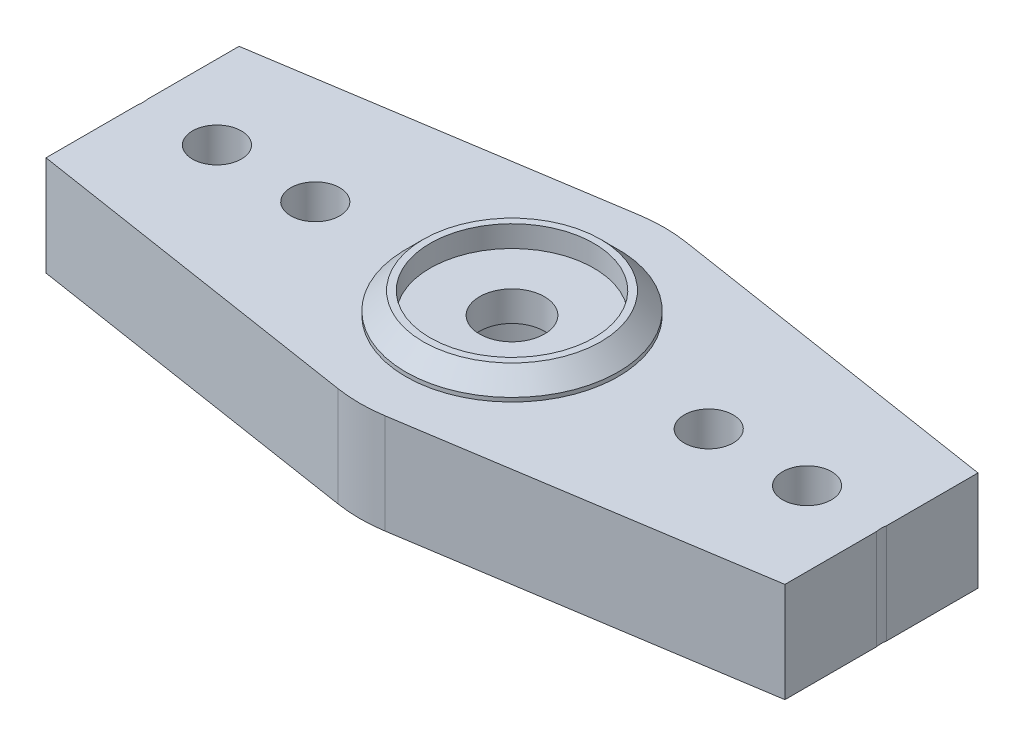
ISO-10303-21;
HEADER;
FILE_DESCRIPTION(('STEP AP214'),'2;1');
FILE_NAME('part.step','',(''),(''),'','','');
FILE_SCHEMA(('AUTOMOTIVE_DESIGN { 1 0 10303 214 1 1 1 1 }'));
ENDSEC;
DATA;
#1=APPLICATION_CONTEXT('core data for automotive mechanical design processes');
#2=APPLICATION_PROTOCOL_DEFINITION('international standard','automotive_design',2000,#1);
#3=PRODUCT_CONTEXT('',#1,'mechanical');
#4=PRODUCT('Part','Part','',(#3));
#5=PRODUCT_RELATED_PRODUCT_CATEGORY('part','',(#4));
#6=PRODUCT_DEFINITION_FORMATION('','',#4);
#7=PRODUCT_DEFINITION_CONTEXT('part definition',#1,'design');
#8=PRODUCT_DEFINITION('design','',#6,#7);
#9=PRODUCT_DEFINITION_SHAPE('','',#8);
#10=(LENGTH_UNIT() NAMED_UNIT(*) SI_UNIT(.MILLI.,.METRE.));
#11=(NAMED_UNIT(*) PLANE_ANGLE_UNIT() SI_UNIT($,.RADIAN.));
#12=(NAMED_UNIT(*) SI_UNIT($,.STERADIAN.) SOLID_ANGLE_UNIT());
#13=UNCERTAINTY_MEASURE_WITH_UNIT(LENGTH_MEASURE(1.E-05),#10,'distance_accuracy_value','');
#14=(GEOMETRIC_REPRESENTATION_CONTEXT(3) GLOBAL_UNCERTAINTY_ASSIGNED_CONTEXT((#13)) GLOBAL_UNIT_ASSIGNED_CONTEXT((#10,
#11,#12)) REPRESENTATION_CONTEXT('',''));
#15=CARTESIAN_POINT('',(0.,0.,0.));
#16=DIRECTION('',(0.,0.,1.));
#17=DIRECTION('',(1.,0.,0.));
#18=AXIS2_PLACEMENT_3D('',#15,#16,#17);
#19=CARTESIAN_POINT('',(0.,5.08,0.));
#20=DIRECTION('',(0.,-1.,0.));
#21=DIRECTION('',(0.,0.,-1.));
#22=AXIS2_PLACEMENT_3D('',#19,#20,#21);
#23=CYLINDRICAL_SURFACE('',#22,1.651);
#24=CARTESIAN_POINT('',(0.,5.08,0.));
#25=DIRECTION('',(0.,1.,0.));
#26=DIRECTION('',(0.,0.,1.));
#27=AXIS2_PLACEMENT_3D('',#24,#25,#26);
#28=CIRCLE('',#27,1.651);
#29=CARTESIAN_POINT('',(0.,5.08,1.651));
#30=VERTEX_POINT('',#29);
#31=EDGE_CURVE('E160',#30,#30,#28,.T.);
#32=ORIENTED_EDGE('',*,*,#31,.T.);
#33=EDGE_LOOP('',(#32));
#34=FACE_BOUND('',#33,.T.);
#35=CARTESIAN_POINT('',(0.,3.556,0.));
#36=DIRECTION('',(0.,-1.,0.));
#37=DIRECTION('',(0.,0.,-1.));
#38=AXIS2_PLACEMENT_3D('',#35,#36,#37);
#39=CIRCLE('',#38,1.651);
#40=CARTESIAN_POINT('',(0.,3.556,-1.651));
#41=VERTEX_POINT('',#40);
#42=EDGE_CURVE('E37',#41,#41,#39,.T.);
#43=ORIENTED_EDGE('',*,*,#42,.T.);
#44=EDGE_LOOP('',(#43));
#45=FACE_BOUND('',#44,.T.);
#46=ADVANCED_FACE('F33',(#34,#45),#23,.F.);
#47=CARTESIAN_POINT('',(-30.0228,5.08,0.));
#48=DIRECTION('',(0.,1.,0.));
#49=DIRECTION('',(0.,0.,1.));
#50=AXIS2_PLACEMENT_3D('',#47,#48,#49);
#51=PLANE('',#50);
#52=ORIENTED_EDGE('',*,*,#31,.F.);
#53=EDGE_LOOP('',(#52));
#54=FACE_BOUND('',#53,.T.);
#55=CARTESIAN_POINT('',(0.,5.08,0.));
#56=DIRECTION('',(0.,1.,0.));
#57=DIRECTION('',(0.,0.,1.));
#58=AXIS2_PLACEMENT_3D('',#55,#56,#57);
#59=CIRCLE('',#58,4.1656);
#60=CARTESIAN_POINT('',(0.,5.08,4.1656));
#61=VERTEX_POINT('',#60);
#62=EDGE_CURVE('E182',#61,#61,#59,.F.);
#63=ORIENTED_EDGE('',*,*,#62,.F.);
#64=EDGE_LOOP('',(#63));
#65=FACE_BOUND('',#64,.T.);
#66=ADVANCED_FACE('F303',(#54,#65),#51,.T.);
#67=DIRECTION('',(0.,0.,1.));
#68=VECTOR('',#67,1.);
#69=CARTESIAN_POINT('',(18.796,5.08,-5.50848114557174));
#70=LINE('',#69,#68);
#71=CARTESIAN_POINT('',(18.796,5.08,-4.91143234469171));
#72=VERTEX_POINT('',#71);
#73=CARTESIAN_POINT('',(18.796,5.08,-0.250160988165604));
#74=VERTEX_POINT('',#73);
#75=EDGE_CURVE('E56',#72,#74,#70,.T.);
#76=ORIENTED_EDGE('',*,*,#75,.F.);
#77=DIRECTION('',(-0.988074539469132,0.,-0.153976311336717));
#78=VECTOR('',#77,1.);
#79=CARTESIAN_POINT('',(30.5038527918782,5.08,-3.08694247620946));
#80=LINE('',#79,#78);
#81=CARTESIAN_POINT('',(1.19285448392555,5.08,-7.65461345726737));
#82=VERTEX_POINT('',#81);
#83=EDGE_CURVE('E133',#72,#82,#80,.T.);
#84=ORIENTED_EDGE('',*,*,#83,.T.);
#85=CARTESIAN_POINT('',(0.,5.08,0.));
#86=DIRECTION('',(0.,1.,0.));
#87=DIRECTION('',(0.,0.,1.));
#88=AXIS2_PLACEMENT_3D('',#85,#86,#87);
#89=CIRCLE('',#88,7.747);
#90=CARTESIAN_POINT('',(-1.19285448392555,5.08,-7.65461345726737));
#91=VERTEX_POINT('',#90);
#92=EDGE_CURVE('E144',#82,#91,#89,.T.);
#93=ORIENTED_EDGE('',*,*,#92,.T.);
#94=DIRECTION('',(-0.988074539469132,0.,0.153976311336717));
#95=VECTOR('',#94,1.);
#96=CARTESIAN_POINT('',(-30.5038527918782,5.08,-3.08694247620946));
#97=LINE('',#96,#95);
#98=CARTESIAN_POINT('',(-18.796,5.08,-4.91143234469171));
#99=VERTEX_POINT('',#98);
#100=EDGE_CURVE('E147',#91,#99,#97,.T.);
#101=ORIENTED_EDGE('',*,*,#100,.T.);
#102=DIRECTION('',(0.,0.,-1.));
#103=VECTOR('',#102,1.);
#104=CARTESIAN_POINT('',(-18.796,5.08,-5.50848114557174));
#105=LINE('',#104,#103);
#106=CARTESIAN_POINT('',(-18.796,5.08,-0.250160988165603));
#107=VERTEX_POINT('',#106);
#108=EDGE_CURVE('E127',#107,#99,#105,.T.);
#109=ORIENTED_EDGE('',*,*,#108,.F.);
#110=CARTESIAN_POINT('',(-20.0152,5.08,0.));
#111=DIRECTION('',(0.,1.,0.));
#112=DIRECTION('',(0.,0.,1.));
#113=AXIS2_PLACEMENT_3D('',#110,#111,#112);
#114=CIRCLE('',#113,1.2446);
#115=CARTESIAN_POINT('',(-18.796,5.08,0.250160988165608));
#116=VERTEX_POINT('',#115);
#117=EDGE_CURVE('E215',#116,#107,#114,.T.);
#118=ORIENTED_EDGE('',*,*,#117,.F.);
#119=CARTESIAN_POINT('',(-18.796,5.08,4.91143234469171));
#120=VERTEX_POINT('',#119);
#121=EDGE_CURVE('E255',#120,#116,#105,.T.);
#122=ORIENTED_EDGE('',*,*,#121,.F.);
#123=DIRECTION('',(0.988074539469133,0.,0.153976311336717));
#124=VECTOR('',#123,1.);
#125=CARTESIAN_POINT('',(-30.5038527918782,5.08,3.08694247620947));
#126=LINE('',#125,#124);
#127=CARTESIAN_POINT('',(-1.19285448392555,5.08,7.65461345726737));
#128=VERTEX_POINT('',#127);
#129=EDGE_CURVE('E172',#120,#128,#126,.T.);
#130=ORIENTED_EDGE('',*,*,#129,.T.);
#131=CARTESIAN_POINT('',(0.,5.08,0.));
#132=DIRECTION('',(0.,1.,0.));
#133=DIRECTION('',(0.,0.,1.));
#134=AXIS2_PLACEMENT_3D('',#131,#132,#133);
#135=CIRCLE('',#134,7.747);
#136=CARTESIAN_POINT('',(1.19285448392555,5.08,7.65461345726737));
#137=VERTEX_POINT('',#136);
#138=EDGE_CURVE('E150',#128,#137,#135,.T.);
#139=ORIENTED_EDGE('',*,*,#138,.T.);
#140=DIRECTION('',(0.988074539469133,0.,-0.153976311336717));
#141=VECTOR('',#140,1.);
#142=CARTESIAN_POINT('',(30.5038527918782,5.08,3.08694247620947));
#143=LINE('',#142,#141);
#144=CARTESIAN_POINT('',(18.796,5.08,4.91143234469171));
#145=VERTEX_POINT('',#144);
#146=EDGE_CURVE('E145',#137,#145,#143,.T.);
#147=ORIENTED_EDGE('',*,*,#146,.T.);
#148=CARTESIAN_POINT('',(18.796,5.08,0.250160988165607));
#149=VERTEX_POINT('',#148);
#150=EDGE_CURVE('E138',#149,#145,#70,.T.);
#151=ORIENTED_EDGE('',*,*,#150,.F.);
#152=CARTESIAN_POINT('',(20.0152,5.08,0.));
#153=DIRECTION('',(0.,1.,0.));
#154=DIRECTION('',(0.,0.,-1.));
#155=AXIS2_PLACEMENT_3D('',#152,#153,#154);
#156=CIRCLE('',#155,1.2446);
#157=EDGE_CURVE('E137',#74,#149,#156,.T.);
#158=ORIENTED_EDGE('',*,*,#157,.F.);
#159=EDGE_LOOP('',(#76,#84,#93,#101,#109,#118,#122,#130,#139,#147,#151,#158));
#160=FACE_BOUND('',#159,.T.);
#161=CARTESIAN_POINT('',(0.,5.08,0.));
#162=DIRECTION('',(0.,1.,0.));
#163=DIRECTION('',(0.,0.,1.));
#164=AXIS2_PLACEMENT_3D('',#161,#162,#163);
#165=CIRCLE('',#164,5.40385);
#166=CARTESIAN_POINT('',(0.,5.08,5.40385));
#167=VERTEX_POINT('',#166);
#168=EDGE_CURVE('E272',#167,#167,#165,.T.);
#169=ORIENTED_EDGE('',*,*,#168,.F.);
#170=EDGE_LOOP('',(#169));
#171=FACE_BOUND('',#170,.T.);
#172=CARTESIAN_POINT('',(15.0114,5.08,0.));
#173=DIRECTION('',(0.,1.,0.));
#174=DIRECTION('',(0.,0.,-1.));
#175=AXIS2_PLACEMENT_3D('',#172,#173,#174);
#176=CIRCLE('',#175,1.2446);
#177=CARTESIAN_POINT('',(15.0114,5.08,-1.2446));
#178=VERTEX_POINT('',#177);
#179=EDGE_CURVE('E217',#178,#178,#176,.T.);
#180=ORIENTED_EDGE('',*,*,#179,.F.);
#181=EDGE_LOOP('',(#180));
#182=FACE_BOUND('',#181,.T.);
#183=CARTESIAN_POINT('',(-10.0076,5.08,0.));
#184=DIRECTION('',(0.,1.,0.));
#185=DIRECTION('',(0.,0.,1.));
#186=AXIS2_PLACEMENT_3D('',#183,#184,#185);
#187=CIRCLE('',#186,1.2446);
#188=CARTESIAN_POINT('',(-10.0076,5.08,1.2446));
#189=VERTEX_POINT('',#188);
#190=EDGE_CURVE('E232',#189,#189,#187,.T.);
#191=ORIENTED_EDGE('',*,*,#190,.F.);
#192=EDGE_LOOP('',(#191));
#193=FACE_BOUND('',#192,.T.);
#194=CARTESIAN_POINT('',(-15.0114,5.08,0.));
#195=DIRECTION('',(0.,1.,0.));
#196=DIRECTION('',(0.,0.,1.));
#197=AXIS2_PLACEMENT_3D('',#194,#195,#196);
#198=CIRCLE('',#197,1.2446);
#199=CARTESIAN_POINT('',(-15.0114,5.08,1.2446));
#200=VERTEX_POINT('',#199);
#201=EDGE_CURVE('E226',#200,#200,#198,.T.);
#202=ORIENTED_EDGE('',*,*,#201,.F.);
#203=EDGE_LOOP('',(#202));
#204=FACE_BOUND('',#203,.T.);
#205=CARTESIAN_POINT('',(10.0076,5.08,0.));
#206=DIRECTION('',(0.,1.,0.));
#207=DIRECTION('',(0.,0.,-1.));
#208=AXIS2_PLACEMENT_3D('',#205,#206,#207);
#209=CIRCLE('',#208,1.2446);
#210=CARTESIAN_POINT('',(10.0076,5.08,-1.2446));
#211=VERTEX_POINT('',#210);
#212=EDGE_CURVE('E276',#211,#211,#209,.T.);
#213=ORIENTED_EDGE('',*,*,#212,.F.);
#214=EDGE_LOOP('',(#213));
#215=FACE_BOUND('',#214,.T.);
#216=ADVANCED_FACE('F131',(#160,#171,#182,#193,#204,#215),#51,.T.);
#217=CARTESIAN_POINT('',(-30.0228,0.,0.));
#218=DIRECTION('',(0.,1.,0.));
#219=DIRECTION('',(0.,0.,1.));
#220=AXIS2_PLACEMENT_3D('',#217,#218,#219);
#221=PLANE('',#220);
#222=CARTESIAN_POINT('',(0.,0.,0.));
#223=DIRECTION('',(0.,1.,0.));
#224=DIRECTION('',(0.,0.,1.));
#225=AXIS2_PLACEMENT_3D('',#222,#223,#224);
#226=CIRCLE('',#225,5.4102);
#227=CARTESIAN_POINT('',(0.,0.,5.4102));
#228=VERTEX_POINT('',#227);
#229=EDGE_CURVE('E191',#228,#228,#226,.F.);
#230=ORIENTED_EDGE('',*,*,#229,.F.);
#231=EDGE_LOOP('',(#230));
#232=FACE_BOUND('',#231,.T.);
#233=CARTESIAN_POINT('',(-10.0076,0.,0.));
#234=DIRECTION('',(0.,1.,0.));
#235=DIRECTION('',(0.,0.,1.));
#236=AXIS2_PLACEMENT_3D('',#233,#234,#235);
#237=CIRCLE('',#236,1.2446);
#238=CARTESIAN_POINT('',(-10.0076,0.,1.2446));
#239=VERTEX_POINT('',#238);
#240=EDGE_CURVE('E229',#239,#239,#237,.T.);
#241=ORIENTED_EDGE('',*,*,#240,.T.);
#242=EDGE_LOOP('',(#241));
#243=FACE_BOUND('',#242,.T.);
#244=CARTESIAN_POINT('',(-15.0114,0.,0.));
#245=DIRECTION('',(0.,1.,0.));
#246=DIRECTION('',(0.,0.,1.));
#247=AXIS2_PLACEMENT_3D('',#244,#245,#246);
#248=CIRCLE('',#247,1.2446);
#249=CARTESIAN_POINT('',(-15.0114,0.,1.2446));
#250=VERTEX_POINT('',#249);
#251=EDGE_CURVE('E224',#250,#250,#248,.T.);
#252=ORIENTED_EDGE('',*,*,#251,.T.);
#253=EDGE_LOOP('',(#252));
#254=FACE_BOUND('',#253,.T.);
#255=DIRECTION('',(-0.988074539469132,0.,-0.153976311336717));
#256=VECTOR('',#255,1.);
#257=CARTESIAN_POINT('',(30.5038527918782,0.,-3.08694247620946));
#258=LINE('',#257,#256);
#259=CARTESIAN_POINT('',(18.796,0.,-4.91143234469171));
#260=VERTEX_POINT('',#259);
#261=CARTESIAN_POINT('',(1.19285448392555,0.,-7.65461345726737));
#262=VERTEX_POINT('',#261);
#263=EDGE_CURVE('E165',#260,#262,#258,.T.);
#264=ORIENTED_EDGE('',*,*,#263,.F.);
#265=DIRECTION('',(0.,0.,1.));
#266=VECTOR('',#265,1.);
#267=CARTESIAN_POINT('',(18.796,0.,0.));
#268=LINE('',#267,#266);
#269=CARTESIAN_POINT('',(18.796,0.,-0.250160988165611));
#270=VERTEX_POINT('',#269);
#271=EDGE_CURVE('E123',#260,#270,#268,.T.);
#272=ORIENTED_EDGE('',*,*,#271,.T.);
#273=CARTESIAN_POINT('',(20.0152,0.,0.));
#274=DIRECTION('',(0.,1.,0.));
#275=DIRECTION('',(0.,0.,-1.));
#276=AXIS2_PLACEMENT_3D('',#273,#274,#275);
#277=CIRCLE('',#276,1.2446);
#278=CARTESIAN_POINT('',(18.796,0.,0.250160988165615));
#279=VERTEX_POINT('',#278);
#280=EDGE_CURVE('E212',#270,#279,#277,.T.);
#281=ORIENTED_EDGE('',*,*,#280,.T.);
#282=CARTESIAN_POINT('',(18.796,0.,4.91143234469171));
#283=VERTEX_POINT('',#282);
#284=EDGE_CURVE('E49',#279,#283,#268,.T.);
#285=ORIENTED_EDGE('',*,*,#284,.T.);
#286=DIRECTION('',(0.988074539469133,0.,-0.153976311336717));
#287=VECTOR('',#286,1.);
#288=CARTESIAN_POINT('',(30.5038527918782,0.,3.08694247620947));
#289=LINE('',#288,#287);
#290=CARTESIAN_POINT('',(1.19285448392555,0.,7.65461345726737));
#291=VERTEX_POINT('',#290);
#292=EDGE_CURVE('E162',#291,#283,#289,.T.);
#293=ORIENTED_EDGE('',*,*,#292,.F.);
#294=CARTESIAN_POINT('',(0.,0.,0.));
#295=DIRECTION('',(0.,1.,0.));
#296=DIRECTION('',(0.,0.,1.));
#297=AXIS2_PLACEMENT_3D('',#294,#295,#296);
#298=CIRCLE('',#297,7.747);
#299=CARTESIAN_POINT('',(-1.19285448392555,0.,7.65461345726737));
#300=VERTEX_POINT('',#299);
#301=EDGE_CURVE('E159',#300,#291,#298,.T.);
#302=ORIENTED_EDGE('',*,*,#301,.F.);
#303=DIRECTION('',(0.988074539469133,0.,0.153976311336717));
#304=VECTOR('',#303,1.);
#305=CARTESIAN_POINT('',(-30.5038527918782,0.,3.08694247620947));
#306=LINE('',#305,#304);
#307=CARTESIAN_POINT('',(-18.796,0.,4.91143234469171));
#308=VERTEX_POINT('',#307);
#309=EDGE_CURVE('E157',#308,#300,#306,.T.);
#310=ORIENTED_EDGE('',*,*,#309,.F.);
#311=DIRECTION('',(0.,0.,-1.));
#312=VECTOR('',#311,1.);
#313=CARTESIAN_POINT('',(-18.796,0.,0.));
#314=LINE('',#313,#312);
#315=CARTESIAN_POINT('',(-18.796,0.,0.250160988165615));
#316=VERTEX_POINT('',#315);
#317=EDGE_CURVE('E260',#308,#316,#314,.T.);
#318=ORIENTED_EDGE('',*,*,#317,.T.);
#319=CARTESIAN_POINT('',(-20.0152,0.,0.));
#320=DIRECTION('',(0.,1.,0.));
#321=DIRECTION('',(0.,0.,1.));
#322=AXIS2_PLACEMENT_3D('',#319,#320,#321);
#323=CIRCLE('',#322,1.2446);
#324=CARTESIAN_POINT('',(-18.796,0.,-0.250160988165611));
#325=VERTEX_POINT('',#324);
#326=EDGE_CURVE('E211',#316,#325,#323,.T.);
#327=ORIENTED_EDGE('',*,*,#326,.T.);
#328=CARTESIAN_POINT('',(-18.796,0.,-4.91143234469171));
#329=VERTEX_POINT('',#328);
#330=EDGE_CURVE('E256',#325,#329,#314,.T.);
#331=ORIENTED_EDGE('',*,*,#330,.T.);
#332=DIRECTION('',(-0.988074539469132,0.,0.153976311336717));
#333=VECTOR('',#332,1.);
#334=CARTESIAN_POINT('',(-30.5038527918782,0.,-3.08694247620946));
#335=LINE('',#334,#333);
#336=CARTESIAN_POINT('',(-1.19285448392555,0.,-7.65461345726737));
#337=VERTEX_POINT('',#336);
#338=EDGE_CURVE('E169',#337,#329,#335,.T.);
#339=ORIENTED_EDGE('',*,*,#338,.F.);
#340=CARTESIAN_POINT('',(0.,0.,0.));
#341=DIRECTION('',(0.,1.,0.));
#342=DIRECTION('',(0.,0.,1.));
#343=AXIS2_PLACEMENT_3D('',#340,#341,#342);
#344=CIRCLE('',#343,7.747);
#345=EDGE_CURVE('E167',#262,#337,#344,.T.);
#346=ORIENTED_EDGE('',*,*,#345,.F.);
#347=EDGE_LOOP('',(#264,#272,#281,#285,#293,#302,#310,#318,#327,#331,#339,#346));
#348=FACE_BOUND('',#347,.T.);
#349=CARTESIAN_POINT('',(15.0114,0.,0.));
#350=DIRECTION('',(0.,1.,0.));
#351=DIRECTION('',(0.,0.,-1.));
#352=AXIS2_PLACEMENT_3D('',#349,#350,#351);
#353=CIRCLE('',#352,1.2446);
#354=CARTESIAN_POINT('',(15.0114,0.,-1.2446));
#355=VERTEX_POINT('',#354);
#356=EDGE_CURVE('E220',#355,#355,#353,.T.);
#357=ORIENTED_EDGE('',*,*,#356,.T.);
#358=EDGE_LOOP('',(#357));
#359=FACE_BOUND('',#358,.T.);
#360=CARTESIAN_POINT('',(10.0076,0.,0.));
#361=DIRECTION('',(0.,1.,0.));
#362=DIRECTION('',(0.,0.,-1.));
#363=AXIS2_PLACEMENT_3D('',#360,#361,#362);
#364=CIRCLE('',#363,1.2446);
#365=CARTESIAN_POINT('',(10.0076,0.,-1.2446));
#366=VERTEX_POINT('',#365);
#367=EDGE_CURVE('E275',#366,#366,#364,.T.);
#368=ORIENTED_EDGE('',*,*,#367,.T.);
#369=EDGE_LOOP('',(#368));
#370=FACE_BOUND('',#369,.T.);
#371=ADVANCED_FACE('F286',(#232,#243,#254,#348,#359,#370),#221,.F.);
#372=CARTESIAN_POINT('',(-30.5038527918782,5.08,3.08694247620947));
#373=DIRECTION('',(0.153976311336717,0.,-0.988074539469132));
#374=DIRECTION('',(-0.988074539469133,0.,-0.153976311336717));
#375=AXIS2_PLACEMENT_3D('',#372,#373,#374);
#376=PLANE('',#375);
#377=ORIENTED_EDGE('',*,*,#129,.F.);
#378=DIRECTION('',(0.,-1.,0.));
#379=VECTOR('',#378,1.);
#380=CARTESIAN_POINT('',(-18.796,5.08,4.91143234469171));
#381=LINE('',#380,#379);
#382=EDGE_CURVE('E263',#120,#308,#381,.T.);
#383=ORIENTED_EDGE('',*,*,#382,.T.);
#384=ORIENTED_EDGE('',*,*,#309,.T.);
#385=DIRECTION('',(0.,-1.,0.));
#386=VECTOR('',#385,1.);
#387=CARTESIAN_POINT('',(-1.19285448392555,5.08,7.65461345726737));
#388=LINE('',#387,#386);
#389=EDGE_CURVE('E179',#128,#300,#388,.T.);
#390=ORIENTED_EDGE('',*,*,#389,.F.);
#391=EDGE_LOOP('',(#377,#383,#384,#390));
#392=FACE_BOUND('',#391,.T.);
#393=ADVANCED_FACE('F321',(#392),#376,.F.);
#394=CARTESIAN_POINT('',(0.,5.08,0.));
#395=DIRECTION('',(0.,-1.,0.));
#396=DIRECTION('',(0.,0.,-1.));
#397=AXIS2_PLACEMENT_3D('',#394,#395,#396);
#398=CYLINDRICAL_SURFACE('',#397,7.747);
#399=ORIENTED_EDGE('',*,*,#301,.T.);
#400=DIRECTION('',(0.,-1.,0.));
#401=VECTOR('',#400,1.);
#402=CARTESIAN_POINT('',(1.19285448392555,5.08,7.65461345726737));
#403=LINE('',#402,#401);
#404=EDGE_CURVE('E176',#137,#291,#403,.T.);
#405=ORIENTED_EDGE('',*,*,#404,.F.);
#406=ORIENTED_EDGE('',*,*,#138,.F.);
#407=ORIENTED_EDGE('',*,*,#389,.T.);
#408=EDGE_LOOP('',(#399,#405,#406,#407));
#409=FACE_BOUND('',#408,.T.);
#410=ADVANCED_FACE('F245',(#409),#398,.T.);
#411=CARTESIAN_POINT('',(30.5038527918782,5.08,3.08694247620947));
#412=DIRECTION('',(-0.153976311336717,0.,-0.988074539469132));
#413=DIRECTION('',(-0.988074539469133,0.,0.153976311336717));
#414=AXIS2_PLACEMENT_3D('',#411,#412,#413);
#415=PLANE('',#414);
#416=ORIENTED_EDGE('',*,*,#292,.T.);
#417=DIRECTION('',(0.,1.,0.));
#418=VECTOR('',#417,1.);
#419=CARTESIAN_POINT('',(18.796,5.08,4.91143234469171));
#420=LINE('',#419,#418);
#421=EDGE_CURVE('E250',#283,#145,#420,.T.);
#422=ORIENTED_EDGE('',*,*,#421,.T.);
#423=ORIENTED_EDGE('',*,*,#146,.F.);
#424=ORIENTED_EDGE('',*,*,#404,.T.);
#425=EDGE_LOOP('',(#416,#422,#423,#424));
#426=FACE_BOUND('',#425,.T.);
#427=ADVANCED_FACE('F249',(#426),#415,.F.);
#428=CARTESIAN_POINT('',(30.5038527918782,5.08,-3.08694247620946));
#429=DIRECTION('',(-0.153976311336718,0.,0.988074539469132));
#430=DIRECTION('',(0.988074539469132,0.,0.153976311336718));
#431=AXIS2_PLACEMENT_3D('',#428,#429,#430);
#432=PLANE('',#431);
#433=ORIENTED_EDGE('',*,*,#83,.F.);
#434=DIRECTION('',(0.,-1.,0.));
#435=VECTOR('',#434,1.);
#436=CARTESIAN_POINT('',(18.796,5.08,-4.91143234469171));
#437=LINE('',#436,#435);
#438=EDGE_CURVE('E120',#72,#260,#437,.T.);
#439=ORIENTED_EDGE('',*,*,#438,.T.);
#440=ORIENTED_EDGE('',*,*,#263,.T.);
#441=DIRECTION('',(0.,-1.,0.));
#442=VECTOR('',#441,1.);
#443=CARTESIAN_POINT('',(1.19285448392555,5.08,-7.65461345726737));
#444=LINE('',#443,#442);
#445=EDGE_CURVE('E142',#82,#262,#444,.T.);
#446=ORIENTED_EDGE('',*,*,#445,.F.);
#447=EDGE_LOOP('',(#433,#439,#440,#446));
#448=FACE_BOUND('',#447,.T.);
#449=ADVANCED_FACE('F140',(#448),#432,.F.);
#450=CARTESIAN_POINT('',(0.,5.08,0.));
#451=DIRECTION('',(0.,-1.,0.));
#452=DIRECTION('',(0.,0.,-1.));
#453=AXIS2_PLACEMENT_3D('',#450,#451,#452);
#454=CYLINDRICAL_SURFACE('',#453,7.747);
#455=ORIENTED_EDGE('',*,*,#345,.T.);
#456=DIRECTION('',(0.,-1.,0.));
#457=VECTOR('',#456,1.);
#458=CARTESIAN_POINT('',(-1.19285448392555,5.08,-7.65461345726737));
#459=LINE('',#458,#457);
#460=EDGE_CURVE('E156',#91,#337,#459,.T.);
#461=ORIENTED_EDGE('',*,*,#460,.F.);
#462=ORIENTED_EDGE('',*,*,#92,.F.);
#463=ORIENTED_EDGE('',*,*,#445,.T.);
#464=EDGE_LOOP('',(#455,#461,#462,#463));
#465=FACE_BOUND('',#464,.T.);
#466=ADVANCED_FACE('F326',(#465),#454,.T.);
#467=CARTESIAN_POINT('',(-30.5038527918782,5.08,-3.08694247620946));
#468=DIRECTION('',(0.153976311336718,0.,0.988074539469132));
#469=DIRECTION('',(0.988074539469132,0.,-0.153976311336718));
#470=AXIS2_PLACEMENT_3D('',#467,#468,#469);
#471=PLANE('',#470);
#472=ORIENTED_EDGE('',*,*,#338,.T.);
#473=DIRECTION('',(0.,1.,0.));
#474=VECTOR('',#473,1.);
#475=CARTESIAN_POINT('',(-18.796,5.08,-4.91143234469171));
#476=LINE('',#475,#474);
#477=EDGE_CURVE('E259',#329,#99,#476,.T.);
#478=ORIENTED_EDGE('',*,*,#477,.T.);
#479=ORIENTED_EDGE('',*,*,#100,.F.);
#480=ORIENTED_EDGE('',*,*,#460,.T.);
#481=EDGE_LOOP('',(#472,#478,#479,#480));
#482=FACE_BOUND('',#481,.T.);
#483=ADVANCED_FACE('F323',(#482),#471,.F.);
#484=CARTESIAN_POINT('',(-10.0076,5.08,0.));
#485=DIRECTION('',(0.,-1.,0.));
#486=DIRECTION('',(0.,0.,-1.));
#487=AXIS2_PLACEMENT_3D('',#484,#485,#486);
#488=CYLINDRICAL_SURFACE('',#487,1.2446);
#489=ORIENTED_EDGE('',*,*,#190,.T.);
#490=EDGE_LOOP('',(#489));
#491=FACE_BOUND('',#490,.T.);
#492=ORIENTED_EDGE('',*,*,#240,.F.);
#493=EDGE_LOOP('',(#492));
#494=FACE_BOUND('',#493,.T.);
#495=ADVANCED_FACE('F315',(#491,#494),#488,.F.);
#496=CARTESIAN_POINT('',(-15.0114,5.08,0.));
#497=DIRECTION('',(0.,-1.,0.));
#498=DIRECTION('',(0.,0.,-1.));
#499=AXIS2_PLACEMENT_3D('',#496,#497,#498);
#500=CYLINDRICAL_SURFACE('',#499,1.2446);
#501=ORIENTED_EDGE('',*,*,#201,.T.);
#502=EDGE_LOOP('',(#501));
#503=FACE_BOUND('',#502,.T.);
#504=ORIENTED_EDGE('',*,*,#251,.F.);
#505=EDGE_LOOP('',(#504));
#506=FACE_BOUND('',#505,.T.);
#507=ADVANCED_FACE('F481',(#503,#506),#500,.F.);
#508=CARTESIAN_POINT('',(-20.0152,5.08,0.));
#509=DIRECTION('',(0.,-1.,0.));
#510=DIRECTION('',(0.,0.,-1.));
#511=AXIS2_PLACEMENT_3D('',#508,#509,#510);
#512=CYLINDRICAL_SURFACE('',#511,1.2446);
#513=DIRECTION('',(0.,-1.,0.));
#514=VECTOR('',#513,1.);
#515=CARTESIAN_POINT('',(-18.796,5.08,0.250160988165615));
#516=LINE('',#515,#514);
#517=EDGE_CURVE('E202',#116,#316,#516,.T.);
#518=ORIENTED_EDGE('',*,*,#517,.F.);
#519=ORIENTED_EDGE('',*,*,#117,.T.);
#520=DIRECTION('',(0.,-1.,0.));
#521=VECTOR('',#520,1.);
#522=CARTESIAN_POINT('',(-18.796,5.08,-0.250160988165611));
#523=LINE('',#522,#521);
#524=EDGE_CURVE('E200',#325,#107,#523,.F.);
#525=ORIENTED_EDGE('',*,*,#524,.F.);
#526=ORIENTED_EDGE('',*,*,#326,.F.);
#527=EDGE_LOOP('',(#518,#519,#525,#526));
#528=FACE_BOUND('',#527,.T.);
#529=ADVANCED_FACE('F300',(#528),#512,.F.);
#530=CARTESIAN_POINT('',(20.0152,5.08,0.));
#531=DIRECTION('',(0.,-1.,0.));
#532=DIRECTION('',(0.,0.,-1.));
#533=AXIS2_PLACEMENT_3D('',#530,#531,#532);
#534=CYLINDRICAL_SURFACE('',#533,1.2446);
#535=DIRECTION('',(0.,-1.,0.));
#536=VECTOR('',#535,1.);
#537=CARTESIAN_POINT('',(18.796,5.08,-0.250160988165611));
#538=LINE('',#537,#536);
#539=EDGE_CURVE('E11',#74,#270,#538,.T.);
#540=ORIENTED_EDGE('',*,*,#539,.F.);
#541=ORIENTED_EDGE('',*,*,#157,.T.);
#542=DIRECTION('',(0.,-1.,0.));
#543=VECTOR('',#542,1.);
#544=CARTESIAN_POINT('',(18.796,5.08,0.250160988165615));
#545=LINE('',#544,#543);
#546=EDGE_CURVE('E42',#279,#149,#545,.F.);
#547=ORIENTED_EDGE('',*,*,#546,.F.);
#548=ORIENTED_EDGE('',*,*,#280,.F.);
#549=EDGE_LOOP('',(#540,#541,#547,#548));
#550=FACE_BOUND('',#549,.T.);
#551=ADVANCED_FACE('F210',(#550),#534,.F.);
#552=CARTESIAN_POINT('',(15.0114,5.08,0.));
#553=DIRECTION('',(0.,-1.,0.));
#554=DIRECTION('',(0.,0.,-1.));
#555=AXIS2_PLACEMENT_3D('',#552,#553,#554);
#556=CYLINDRICAL_SURFACE('',#555,1.2446);
#557=ORIENTED_EDGE('',*,*,#179,.T.);
#558=EDGE_LOOP('',(#557));
#559=FACE_BOUND('',#558,.T.);
#560=ORIENTED_EDGE('',*,*,#356,.F.);
#561=EDGE_LOOP('',(#560));
#562=FACE_BOUND('',#561,.T.);
#563=ADVANCED_FACE('F289',(#559,#562),#556,.F.);
#564=CARTESIAN_POINT('',(10.0076,5.08,0.));
#565=DIRECTION('',(0.,-1.,0.));
#566=DIRECTION('',(0.,0.,-1.));
#567=AXIS2_PLACEMENT_3D('',#564,#565,#566);
#568=CYLINDRICAL_SURFACE('',#567,1.2446);
#569=ORIENTED_EDGE('',*,*,#212,.T.);
#570=EDGE_LOOP('',(#569));
#571=FACE_BOUND('',#570,.T.);
#572=ORIENTED_EDGE('',*,*,#367,.F.);
#573=EDGE_LOOP('',(#572));
#574=FACE_BOUND('',#573,.T.);
#575=ADVANCED_FACE('F291',(#571,#574),#568,.F.);
#576=CARTESIAN_POINT('',(0.,6.1722,0.));
#577=DIRECTION('',(0.,1.,0.));
#578=DIRECTION('',(0.,0.,1.));
#579=AXIS2_PLACEMENT_3D('',#576,#577,#578);
#580=PLANE('',#579);
#581=CARTESIAN_POINT('',(0.,6.1722,0.));
#582=DIRECTION('',(0.,1.,0.));
#583=DIRECTION('',(0.,0.,1.));
#584=AXIS2_PLACEMENT_3D('',#581,#582,#583);
#585=CIRCLE('',#584,4.51484999999999);
#586=CARTESIAN_POINT('',(0.,6.1722,4.51484999999999));
#587=VERTEX_POINT('',#586);
#588=EDGE_CURVE('E185',#587,#587,#585,.T.);
#589=ORIENTED_EDGE('',*,*,#588,.T.);
#590=EDGE_LOOP('',(#589));
#591=FACE_BOUND('',#590,.T.);
#592=CARTESIAN_POINT('',(0.,6.1722,0.));
#593=DIRECTION('',(0.,1.,0.));
#594=DIRECTION('',(0.,0.,1.));
#595=AXIS2_PLACEMENT_3D('',#592,#593,#594);
#596=CIRCLE('',#595,4.1656);
#597=CARTESIAN_POINT('',(0.,6.1722,4.1656));
#598=VERTEX_POINT('',#597);
#599=EDGE_CURVE('E269',#598,#598,#596,.T.);
#600=ORIENTED_EDGE('',*,*,#599,.F.);
#601=EDGE_LOOP('',(#600));
#602=FACE_BOUND('',#601,.T.);
#603=ADVANCED_FACE('F297',(#591,#602),#580,.T.);
#604=CARTESIAN_POINT('',(0.,6.1722,0.));
#605=DIRECTION('',(0.,-1.,0.));
#606=DIRECTION('',(0.,0.,-1.));
#607=AXIS2_PLACEMENT_3D('',#604,#605,#606);
#608=CYLINDRICAL_SURFACE('',#607,5.40385);
#609=CARTESIAN_POINT('',(0.,5.28319999999998,0.));
#610=DIRECTION('',(0.,1.,0.));
#611=DIRECTION('',(0.,0.,1.));
#612=AXIS2_PLACEMENT_3D('',#609,#610,#611);
#613=CIRCLE('',#612,5.40385);
#614=CARTESIAN_POINT('',(0.,5.28319999999998,5.40385));
#615=VERTEX_POINT('',#614);
#616=EDGE_CURVE('E188',#615,#615,#613,.F.);
#617=ORIENTED_EDGE('',*,*,#616,.T.);
#618=EDGE_LOOP('',(#617));
#619=FACE_BOUND('',#618,.T.);
#620=ORIENTED_EDGE('',*,*,#168,.T.);
#621=EDGE_LOOP('',(#620));
#622=FACE_BOUND('',#621,.T.);
#623=ADVANCED_FACE('F351',(#619,#622),#608,.T.);
#624=CARTESIAN_POINT('',(0.,6.1722,0.));
#625=DIRECTION('',(0.,-1.,0.));
#626=DIRECTION('',(0.,0.,-1.));
#627=AXIS2_PLACEMENT_3D('',#624,#625,#626);
#628=CYLINDRICAL_SURFACE('',#627,4.1656);
#629=ORIENTED_EDGE('',*,*,#599,.T.);
#630=EDGE_LOOP('',(#629));
#631=FACE_BOUND('',#630,.T.);
#632=ORIENTED_EDGE('',*,*,#62,.T.);
#633=EDGE_LOOP('',(#632));
#634=FACE_BOUND('',#633,.T.);
#635=ADVANCED_FACE('F342',(#631,#634),#628,.F.);
#636=CARTESIAN_POINT('',(0.,6.1722,0.));
#637=DIRECTION('',(0.,-1.,0.));
#638=DIRECTION('',(0.,0.,-1.));
#639=AXIS2_PLACEMENT_3D('',#636,#637,#638);
#640=CONICAL_SURFACE('',#639,4.51484999999999,0.785398163397443);
#641=ORIENTED_EDGE('',*,*,#616,.F.);
#642=EDGE_LOOP('',(#641));
#643=FACE_BOUND('',#642,.T.);
#644=ORIENTED_EDGE('',*,*,#588,.F.);
#645=EDGE_LOOP('',(#644));
#646=FACE_BOUND('',#645,.T.);
#647=ADVANCED_FACE('F339',(#643,#646),#640,.T.);
#648=CARTESIAN_POINT('',(0.,-1.4986,0.));
#649=DIRECTION('',(0.,-1.,0.));
#650=DIRECTION('',(0.,0.,-1.));
#651=AXIS2_PLACEMENT_3D('',#648,#649,#650);
#652=PLANE('',#651);
#653=CARTESIAN_POINT('',(0.,-1.4986,0.));
#654=DIRECTION('',(0.,-1.,0.));
#655=DIRECTION('',(0.,0.,-1.));
#656=AXIS2_PLACEMENT_3D('',#653,#654,#655);
#657=CIRCLE('',#656,5.15620000000003);
#658=CARTESIAN_POINT('',(0.,-1.4986,-5.15620000000003));
#659=VERTEX_POINT('',#658);
#660=EDGE_CURVE('E194',#659,#659,#657,.T.);
#661=ORIENTED_EDGE('',*,*,#660,.T.);
#662=EDGE_LOOP('',(#661));
#663=FACE_BOUND('',#662,.T.);
#664=CARTESIAN_POINT('',(0.,-1.4986,0.));
#665=DIRECTION('',(0.,-1.,0.));
#666=DIRECTION('',(0.,0.,-1.));
#667=AXIS2_PLACEMENT_3D('',#664,#665,#666);
#668=CIRCLE('',#667,4.1656);
#669=CARTESIAN_POINT('',(0.,-1.4986,-4.1656));
#670=VERTEX_POINT('',#669);
#671=EDGE_CURVE('E266',#670,#670,#668,.T.);
#672=ORIENTED_EDGE('',*,*,#671,.F.);
#673=EDGE_LOOP('',(#672));
#674=FACE_BOUND('',#673,.T.);
#675=ADVANCED_FACE('F341',(#663,#674),#652,.T.);
#676=CARTESIAN_POINT('',(0.,-1.4986,0.));
#677=DIRECTION('',(0.,1.,0.));
#678=DIRECTION('',(0.,0.,1.));
#679=AXIS2_PLACEMENT_3D('',#676,#677,#678);
#680=CYLINDRICAL_SURFACE('',#679,5.4102);
#681=CARTESIAN_POINT('',(0.,-1.24460000000003,0.));
#682=DIRECTION('',(0.,-1.,0.));
#683=DIRECTION('',(0.,0.,-1.));
#684=AXIS2_PLACEMENT_3D('',#681,#682,#683);
#685=CIRCLE('',#684,5.4102);
#686=CARTESIAN_POINT('',(0.,-1.24460000000003,-5.4102));
#687=VERTEX_POINT('',#686);
#688=EDGE_CURVE('E197',#687,#687,#685,.F.);
#689=ORIENTED_EDGE('',*,*,#688,.T.);
#690=EDGE_LOOP('',(#689));
#691=FACE_BOUND('',#690,.T.);
#692=ORIENTED_EDGE('',*,*,#229,.T.);
#693=EDGE_LOOP('',(#692));
#694=FACE_BOUND('',#693,.T.);
#695=ADVANCED_FACE('F348',(#691,#694),#680,.T.);
#696=CARTESIAN_POINT('',(0.,-1.4986,0.));
#697=DIRECTION('',(0.,1.,0.));
#698=DIRECTION('',(0.,0.,1.));
#699=AXIS2_PLACEMENT_3D('',#696,#697,#698);
#700=CYLINDRICAL_SURFACE('',#699,4.1656);
#701=ORIENTED_EDGE('',*,*,#671,.T.);
#702=EDGE_LOOP('',(#701));
#703=FACE_BOUND('',#702,.T.);
#704=CARTESIAN_POINT('',(0.,3.556,0.));
#705=DIRECTION('',(0.,-1.,0.));
#706=DIRECTION('',(0.,0.,-1.));
#707=AXIS2_PLACEMENT_3D('',#704,#705,#706);
#708=CIRCLE('',#707,4.1656);
#709=CARTESIAN_POINT('',(0.,3.556,-4.1656));
#710=VERTEX_POINT('',#709);
#711=EDGE_CURVE('E395',#710,#710,#708,.T.);
#712=ORIENTED_EDGE('',*,*,#711,.F.);
#713=EDGE_LOOP('',(#712));
#714=FACE_BOUND('',#713,.T.);
#715=ADVANCED_FACE('F372',(#703,#714),#700,.F.);
#716=CARTESIAN_POINT('',(0.,-1.4986,0.));
#717=DIRECTION('',(0.,1.,0.));
#718=DIRECTION('',(0.,0.,1.));
#719=AXIS2_PLACEMENT_3D('',#716,#717,#718);
#720=CONICAL_SURFACE('',#719,5.15620000000003,0.785398163397452);
#721=ORIENTED_EDGE('',*,*,#688,.F.);
#722=EDGE_LOOP('',(#721));
#723=FACE_BOUND('',#722,.T.);
#724=ORIENTED_EDGE('',*,*,#660,.F.);
#725=EDGE_LOOP('',(#724));
#726=FACE_BOUND('',#725,.T.);
#727=ADVANCED_FACE('F35',(#723,#726),#720,.T.);
#728=CARTESIAN_POINT('',(-18.796,-1.4986,-5.50848114557174));
#729=DIRECTION('',(1.,0.,0.));
#730=DIRECTION('',(0.,0.,-1.));
#731=AXIS2_PLACEMENT_3D('',#728,#729,#730);
#732=PLANE('',#731);
#733=ORIENTED_EDGE('',*,*,#330,.F.);
#734=ORIENTED_EDGE('',*,*,#524,.T.);
#735=ORIENTED_EDGE('',*,*,#108,.T.);
#736=ORIENTED_EDGE('',*,*,#477,.F.);
#737=EDGE_LOOP('',(#733,#734,#735,#736));
#738=FACE_BOUND('',#737,.T.);
#739=ADVANCED_FACE('F381',(#738),#732,.F.);
#740=ORIENTED_EDGE('',*,*,#121,.T.);
#741=ORIENTED_EDGE('',*,*,#517,.T.);
#742=ORIENTED_EDGE('',*,*,#317,.F.);
#743=ORIENTED_EDGE('',*,*,#382,.F.);
#744=EDGE_LOOP('',(#740,#741,#742,#743));
#745=FACE_BOUND('',#744,.T.);
#746=ADVANCED_FACE('F378',(#745),#732,.F.);
#747=CARTESIAN_POINT('',(18.796,-1.4986,-5.50848114557174));
#748=DIRECTION('',(-1.,0.,0.));
#749=DIRECTION('',(0.,0.,1.));
#750=AXIS2_PLACEMENT_3D('',#747,#748,#749);
#751=PLANE('',#750);
#752=ORIENTED_EDGE('',*,*,#284,.F.);
#753=ORIENTED_EDGE('',*,*,#546,.T.);
#754=ORIENTED_EDGE('',*,*,#150,.T.);
#755=ORIENTED_EDGE('',*,*,#421,.F.);
#756=EDGE_LOOP('',(#752,#753,#754,#755));
#757=FACE_BOUND('',#756,.T.);
#758=ADVANCED_FACE('F204',(#757),#751,.F.);
#759=ORIENTED_EDGE('',*,*,#75,.T.);
#760=ORIENTED_EDGE('',*,*,#539,.T.);
#761=ORIENTED_EDGE('',*,*,#271,.F.);
#762=ORIENTED_EDGE('',*,*,#438,.F.);
#763=EDGE_LOOP('',(#759,#760,#761,#762));
#764=FACE_BOUND('',#763,.T.);
#765=ADVANCED_FACE('F121',(#764),#751,.F.);
#766=CARTESIAN_POINT('',(0.,3.556,0.));
#767=DIRECTION('',(0.,-1.,0.));
#768=DIRECTION('',(0.,0.,-1.));
#769=AXIS2_PLACEMENT_3D('',#766,#767,#768);
#770=PLANE('',#769);
#771=ORIENTED_EDGE('',*,*,#42,.F.);
#772=EDGE_LOOP('',(#771));
#773=FACE_BOUND('',#772,.T.);
#774=ORIENTED_EDGE('',*,*,#711,.T.);
#775=EDGE_LOOP('',(#774));
#776=FACE_BOUND('',#775,.T.);
#777=ADVANCED_FACE('F385',(#773,#776),#770,.T.);
#778=CLOSED_SHELL('',(#46,#66,#216,#371,#393,#410,#427,#449,#466,#483,#495,#507,#529,#551,#563,
#575,#603,#623,#635,#647,#675,#695,#715,#727,#739,#746,#758,#765,#777));
#779=MANIFOLD_SOLID_BREP('B2',#778);
#780=ADVANCED_BREP_SHAPE_REPRESENTATION('',(#18,#779),#14);
#781=SHAPE_DEFINITION_REPRESENTATION(#9,#780);
ENDSEC;
END-ISO-10303-21;
